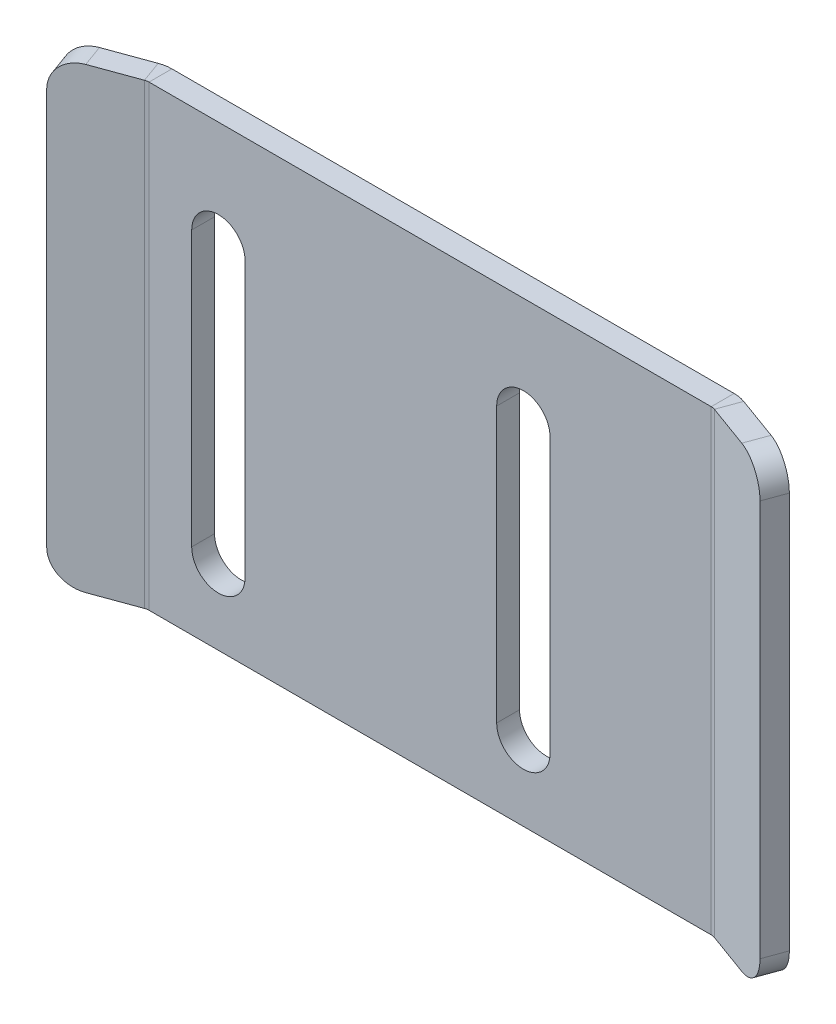
ISO-10303-21;
HEADER;
FILE_DESCRIPTION(('STEP AP214'),'2;1');
FILE_NAME('part.step','',(''),(''),'','','');
FILE_SCHEMA(('AUTOMOTIVE_DESIGN { 1 0 10303 214 1 1 1 1 }'));
ENDSEC;
DATA;
#1=APPLICATION_CONTEXT('core data for automotive mechanical design processes');
#2=APPLICATION_PROTOCOL_DEFINITION('international standard','automotive_design',2000,#1);
#3=PRODUCT_CONTEXT('',#1,'mechanical');
#4=PRODUCT('Part','Part','',(#3));
#5=PRODUCT_RELATED_PRODUCT_CATEGORY('part','',(#4));
#6=PRODUCT_DEFINITION_FORMATION('','',#4);
#7=PRODUCT_DEFINITION_CONTEXT('part definition',#1,'design');
#8=PRODUCT_DEFINITION('design','',#6,#7);
#9=PRODUCT_DEFINITION_SHAPE('','',#8);
#10=(LENGTH_UNIT() NAMED_UNIT(*) SI_UNIT(.MILLI.,.METRE.));
#11=(NAMED_UNIT(*) PLANE_ANGLE_UNIT() SI_UNIT($,.RADIAN.));
#12=(NAMED_UNIT(*) SI_UNIT($,.STERADIAN.) SOLID_ANGLE_UNIT());
#13=UNCERTAINTY_MEASURE_WITH_UNIT(LENGTH_MEASURE(1.E-05),#10,'distance_accuracy_value','');
#14=(GEOMETRIC_REPRESENTATION_CONTEXT(3) GLOBAL_UNCERTAINTY_ASSIGNED_CONTEXT((#13)) GLOBAL_UNIT_ASSIGNED_CONTEXT((#10,
#11,#12)) REPRESENTATION_CONTEXT('',''));
#15=CARTESIAN_POINT('',(0.,0.,0.));
#16=DIRECTION('',(0.,0.,1.));
#17=DIRECTION('',(1.,0.,0.));
#18=AXIS2_PLACEMENT_3D('',#15,#16,#17);
#19=CARTESIAN_POINT('',(0.,0.,-1.5));
#20=DIRECTION('',(0.,0.,1.));
#21=DIRECTION('',(1.,0.,0.));
#22=AXIS2_PLACEMENT_3D('',#19,#20,#21);
#23=PLANE('',#22);
#24=DIRECTION('',(0.,1.,0.));
#25=VECTOR('',#24,1.);
#26=CARTESIAN_POINT('',(35.0734860764899,-0.496153846153827,-1.5));
#27=LINE('',#26,#25);
#28=CARTESIAN_POINT('',(35.0734860764899,-18.4961538461538,-1.5));
#29=VERTEX_POINT('',#28);
#30=CARTESIAN_POINT('',(35.0734860764899,-0.496153846153827,-1.5));
#31=VERTEX_POINT('',#30);
#32=EDGE_CURVE('E252',#29,#31,#27,.T.);
#33=ORIENTED_EDGE('',*,*,#32,.T.);
#34=CARTESIAN_POINT('',(33.3234860764899,-0.496153846153827,-1.5));
#35=DIRECTION('',(0.,0.,1.));
#36=DIRECTION('',(1.,0.,0.));
#37=AXIS2_PLACEMENT_3D('',#34,#35,#36);
#38=CIRCLE('',#37,1.75);
#39=CARTESIAN_POINT('',(31.5734860764899,-0.496153846153828,-1.5));
#40=VERTEX_POINT('',#39);
#41=EDGE_CURVE('E244',#31,#40,#38,.T.);
#42=ORIENTED_EDGE('',*,*,#41,.T.);
#43=DIRECTION('',(0.,-1.,0.));
#44=VECTOR('',#43,1.);
#45=CARTESIAN_POINT('',(31.5734860764899,-0.496153846153828,-1.5));
#46=LINE('',#45,#44);
#47=CARTESIAN_POINT('',(31.5734860764899,-18.4961538461538,-1.5));
#48=VERTEX_POINT('',#47);
#49=EDGE_CURVE('E256',#40,#48,#46,.T.);
#50=ORIENTED_EDGE('',*,*,#49,.T.);
#51=CARTESIAN_POINT('',(33.3234860764899,-18.4961538461538,-1.5));
#52=DIRECTION('',(0.,0.,1.));
#53=DIRECTION('',(1.,0.,0.));
#54=AXIS2_PLACEMENT_3D('',#51,#52,#53);
#55=CIRCLE('',#54,1.75000000000001);
#56=EDGE_CURVE('E260',#48,#29,#55,.T.);
#57=ORIENTED_EDGE('',*,*,#56,.T.);
#58=EDGE_LOOP('',(#33,#42,#50,#57));
#59=FACE_BOUND('',#58,.T.);
#60=DIRECTION('',(0.,1.,0.));
#61=VECTOR('',#60,1.);
#62=CARTESIAN_POINT('',(15.0734860764899,-0.496153846153848,-1.5));
#63=LINE('',#62,#61);
#64=CARTESIAN_POINT('',(15.0734860764899,-18.4961538461538,-1.5));
#65=VERTEX_POINT('',#64);
#66=CARTESIAN_POINT('',(15.0734860764899,-0.496153846153848,-1.5));
#67=VERTEX_POINT('',#66);
#68=EDGE_CURVE('E293',#65,#67,#63,.T.);
#69=ORIENTED_EDGE('',*,*,#68,.T.);
#70=CARTESIAN_POINT('',(13.3234860764899,-0.496153846153848,-1.5));
#71=DIRECTION('',(0.,0.,1.));
#72=DIRECTION('',(1.,0.,0.));
#73=AXIS2_PLACEMENT_3D('',#70,#71,#72);
#74=CIRCLE('',#73,1.75);
#75=CARTESIAN_POINT('',(11.5734860764899,-0.496153846153848,-1.5));
#76=VERTEX_POINT('',#75);
#77=EDGE_CURVE('E283',#67,#76,#74,.T.);
#78=ORIENTED_EDGE('',*,*,#77,.T.);
#79=DIRECTION('',(0.,-1.,0.));
#80=VECTOR('',#79,1.);
#81=CARTESIAN_POINT('',(11.5734860764899,-0.496153846153848,-1.5));
#82=LINE('',#81,#80);
#83=CARTESIAN_POINT('',(11.5734860764899,-18.4961538461538,-1.5));
#84=VERTEX_POINT('',#83);
#85=EDGE_CURVE('E286',#76,#84,#82,.T.);
#86=ORIENTED_EDGE('',*,*,#85,.T.);
#87=CARTESIAN_POINT('',(13.3234860764899,-18.4961538461538,-1.5));
#88=DIRECTION('',(0.,0.,1.));
#89=DIRECTION('',(1.,0.,0.));
#90=AXIS2_PLACEMENT_3D('',#87,#88,#89);
#91=CIRCLE('',#90,1.75);
#92=EDGE_CURVE('E290',#84,#65,#91,.T.);
#93=ORIENTED_EDGE('',*,*,#92,.T.);
#94=EDGE_LOOP('',(#69,#78,#86,#93));
#95=FACE_BOUND('',#94,.T.);
#96=DIRECTION('',(0.,1.,0.));
#97=VECTOR('',#96,1.);
#98=CARTESIAN_POINT('',(45.6442400055945,6.50384615384615,-1.5));
#99=LINE('',#98,#97);
#100=CARTESIAN_POINT('',(45.6442400055945,6.50384615384615,-1.5));
#101=VERTEX_POINT('',#100);
#102=CARTESIAN_POINT('',(45.6442400055945,-23.4961538461538,-1.5));
#103=VERTEX_POINT('',#102);
#104=EDGE_CURVE('E338',#101,#103,#99,.F.);
#105=ORIENTED_EDGE('',*,*,#104,.T.);
#106=DIRECTION('',(1.,0.,0.));
#107=VECTOR('',#106,1.);
#108=CARTESIAN_POINT('',(4.25982905982907,-23.4961538461538,-1.5));
#109=LINE('',#108,#107);
#110=CARTESIAN_POINT('',(8.77541811406363,-23.4961538461538,-1.5));
#111=VERTEX_POINT('',#110);
#112=EDGE_CURVE('E412',#111,#103,#109,.T.);
#113=ORIENTED_EDGE('',*,*,#112,.F.);
#114=DIRECTION('',(0.,-1.,0.));
#115=VECTOR('',#114,1.);
#116=CARTESIAN_POINT('',(8.77541811406363,-23.4961538461538,-1.5));
#117=LINE('',#116,#115);
#118=CARTESIAN_POINT('',(8.77541811406363,6.50384615384616,-1.5));
#119=VERTEX_POINT('',#118);
#120=EDGE_CURVE('E388',#111,#119,#117,.F.);
#121=ORIENTED_EDGE('',*,*,#120,.T.);
#122=DIRECTION('',(-1.,0.,0.));
#123=VECTOR('',#122,1.);
#124=CARTESIAN_POINT('',(4.25982905982907,6.50384615384615,-1.5));
#125=LINE('',#124,#123);
#126=EDGE_CURVE('E415',#101,#119,#125,.T.);
#127=ORIENTED_EDGE('',*,*,#126,.F.);
#128=EDGE_LOOP('',(#105,#113,#121,#127));
#129=FACE_BOUND('',#128,.T.);
#130=ADVANCED_FACE('F77',(#59,#95,#129),#23,.F.);
#131=CARTESIAN_POINT('',(0.,0.,0.));
#132=DIRECTION('',(0.,0.,1.));
#133=DIRECTION('',(1.,0.,0.));
#134=AXIS2_PLACEMENT_3D('',#131,#132,#133);
#135=PLANE('',#134);
#136=CARTESIAN_POINT('',(33.3234860764899,-0.496153846153827,0.));
#137=DIRECTION('',(0.,0.,1.));
#138=DIRECTION('',(1.,0.,0.));
#139=AXIS2_PLACEMENT_3D('',#136,#137,#138);
#140=CIRCLE('',#139,1.75);
#141=CARTESIAN_POINT('',(35.0734860764899,-0.496153846153827,0.));
#142=VERTEX_POINT('',#141);
#143=CARTESIAN_POINT('',(31.5734860764899,-0.496153846153828,0.));
#144=VERTEX_POINT('',#143);
#145=EDGE_CURVE('E247',#142,#144,#140,.T.);
#146=ORIENTED_EDGE('',*,*,#145,.F.);
#147=DIRECTION('',(0.,1.,0.));
#148=VECTOR('',#147,1.);
#149=CARTESIAN_POINT('',(35.0734860764899,-0.496153846153827,0.));
#150=LINE('',#149,#148);
#151=CARTESIAN_POINT('',(35.0734860764899,-18.4961538461538,0.));
#152=VERTEX_POINT('',#151);
#153=EDGE_CURVE('E264',#152,#142,#150,.T.);
#154=ORIENTED_EDGE('',*,*,#153,.F.);
#155=CARTESIAN_POINT('',(33.3234860764899,-18.4961538461538,0.));
#156=DIRECTION('',(0.,0.,1.));
#157=DIRECTION('',(1.,0.,0.));
#158=AXIS2_PLACEMENT_3D('',#155,#156,#157);
#159=CIRCLE('',#158,1.75000000000001);
#160=CARTESIAN_POINT('',(31.5734860764899,-18.4961538461538,0.));
#161=VERTEX_POINT('',#160);
#162=EDGE_CURVE('E267',#161,#152,#159,.T.);
#163=ORIENTED_EDGE('',*,*,#162,.F.);
#164=DIRECTION('',(0.,-1.,0.));
#165=VECTOR('',#164,1.);
#166=CARTESIAN_POINT('',(31.5734860764899,-0.496153846153828,0.));
#167=LINE('',#166,#165);
#168=EDGE_CURVE('E273',#144,#161,#167,.T.);
#169=ORIENTED_EDGE('',*,*,#168,.F.);
#170=EDGE_LOOP('',(#146,#154,#163,#169));
#171=FACE_BOUND('',#170,.T.);
#172=CARTESIAN_POINT('',(13.3234860764899,-0.496153846153848,0.));
#173=DIRECTION('',(0.,0.,1.));
#174=DIRECTION('',(1.,0.,0.));
#175=AXIS2_PLACEMENT_3D('',#172,#173,#174);
#176=CIRCLE('',#175,1.75);
#177=CARTESIAN_POINT('',(15.0734860764899,-0.496153846153848,0.));
#178=VERTEX_POINT('',#177);
#179=CARTESIAN_POINT('',(11.5734860764899,-0.496153846153848,0.));
#180=VERTEX_POINT('',#179);
#181=EDGE_CURVE('E279',#178,#180,#176,.T.);
#182=ORIENTED_EDGE('',*,*,#181,.F.);
#183=DIRECTION('',(0.,1.,0.));
#184=VECTOR('',#183,1.);
#185=CARTESIAN_POINT('',(15.0734860764899,-0.496153846153848,0.));
#186=LINE('',#185,#184);
#187=CARTESIAN_POINT('',(15.0734860764899,-18.4961538461538,0.));
#188=VERTEX_POINT('',#187);
#189=EDGE_CURVE('E287',#188,#178,#186,.T.);
#190=ORIENTED_EDGE('',*,*,#189,.F.);
#191=CARTESIAN_POINT('',(13.3234860764899,-18.4961538461538,0.));
#192=DIRECTION('',(0.,0.,1.));
#193=DIRECTION('',(1.,0.,0.));
#194=AXIS2_PLACEMENT_3D('',#191,#192,#193);
#195=CIRCLE('',#194,1.75);
#196=CARTESIAN_POINT('',(11.5734860764899,-18.4961538461538,0.));
#197=VERTEX_POINT('',#196);
#198=EDGE_CURVE('E301',#197,#188,#195,.T.);
#199=ORIENTED_EDGE('',*,*,#198,.F.);
#200=DIRECTION('',(0.,-1.,0.));
#201=VECTOR('',#200,1.);
#202=CARTESIAN_POINT('',(11.5734860764899,-0.496153846153848,0.));
#203=LINE('',#202,#201);
#204=EDGE_CURVE('E298',#180,#197,#203,.T.);
#205=ORIENTED_EDGE('',*,*,#204,.F.);
#206=EDGE_LOOP('',(#182,#190,#199,#205));
#207=FACE_BOUND('',#206,.T.);
#208=DIRECTION('',(1.,0.,0.));
#209=VECTOR('',#208,1.);
#210=CARTESIAN_POINT('',(4.25982905982907,-23.4961538461538,0.));
#211=LINE('',#210,#209);
#212=CARTESIAN_POINT('',(8.77541811406363,-23.4961538461538,0.));
#213=VERTEX_POINT('',#212);
#214=CARTESIAN_POINT('',(45.6442400055945,-23.4961538461538,0.));
#215=VERTEX_POINT('',#214);
#216=EDGE_CURVE('E409',#213,#215,#211,.T.);
#217=ORIENTED_EDGE('',*,*,#216,.T.);
#218=DIRECTION('',(0.,1.,0.));
#219=VECTOR('',#218,1.);
#220=CARTESIAN_POINT('',(45.6442400055945,6.50384615384615,0.));
#221=LINE('',#220,#219);
#222=CARTESIAN_POINT('',(45.6442400055945,6.50384615384615,0.));
#223=VERTEX_POINT('',#222);
#224=EDGE_CURVE('E350',#223,#215,#221,.F.);
#225=ORIENTED_EDGE('',*,*,#224,.F.);
#226=DIRECTION('',(-1.,0.,0.));
#227=VECTOR('',#226,1.);
#228=CARTESIAN_POINT('',(4.25982905982907,6.50384615384615,0.));
#229=LINE('',#228,#227);
#230=CARTESIAN_POINT('',(8.77541811406363,6.50384615384615,0.));
#231=VERTEX_POINT('',#230);
#232=EDGE_CURVE('E416',#223,#231,#229,.T.);
#233=ORIENTED_EDGE('',*,*,#232,.T.);
#234=DIRECTION('',(0.,-1.,0.));
#235=VECTOR('',#234,1.);
#236=CARTESIAN_POINT('',(8.77541811406363,-23.4961538461538,0.));
#237=LINE('',#236,#235);
#238=EDGE_CURVE('E401',#213,#231,#237,.F.);
#239=ORIENTED_EDGE('',*,*,#238,.F.);
#240=EDGE_LOOP('',(#217,#225,#233,#239));
#241=FACE_BOUND('',#240,.T.);
#242=ADVANCED_FACE('F490',(#171,#207,#241),#135,.T.);
#243=CARTESIAN_POINT('',(4.25982905982907,6.50384615384615,-1.5));
#244=DIRECTION('',(0.,1.,0.));
#245=DIRECTION('',(0.,0.,1.));
#246=AXIS2_PLACEMENT_3D('',#243,#244,#245);
#247=PLANE('',#246);
#248=ORIENTED_EDGE('',*,*,#232,.F.);
#249=DIRECTION('',(0.,0.,-1.));
#250=VECTOR('',#249,1.);
#251=CARTESIAN_POINT('',(45.6442400055945,6.50384615384615,0.));
#252=LINE('',#251,#250);
#253=EDGE_CURVE('E344',#223,#101,#252,.T.);
#254=ORIENTED_EDGE('',*,*,#253,.T.);
#255=ORIENTED_EDGE('',*,*,#126,.T.);
#256=DIRECTION('',(0.,0.,-1.));
#257=VECTOR('',#256,1.);
#258=CARTESIAN_POINT('',(8.77541811406363,6.50384615384615,0.));
#259=LINE('',#258,#257);
#260=EDGE_CURVE('E406',#231,#119,#259,.T.);
#261=ORIENTED_EDGE('',*,*,#260,.F.);
#262=EDGE_LOOP('',(#248,#254,#255,#261));
#263=FACE_BOUND('',#262,.T.);
#264=ADVANCED_FACE('F508',(#263),#247,.T.);
#265=CARTESIAN_POINT('',(4.25982905982907,-23.4961538461538,-1.5));
#266=DIRECTION('',(0.,-1.,0.));
#267=DIRECTION('',(0.,0.,-1.));
#268=AXIS2_PLACEMENT_3D('',#265,#266,#267);
#269=PLANE('',#268);
#270=DIRECTION('',(0.,0.,-1.));
#271=VECTOR('',#270,1.);
#272=CARTESIAN_POINT('',(45.6442400055945,-23.4961538461538,0.));
#273=LINE('',#272,#271);
#274=EDGE_CURVE('E355',#215,#103,#273,.T.);
#275=ORIENTED_EDGE('',*,*,#274,.F.);
#276=ORIENTED_EDGE('',*,*,#216,.F.);
#277=DIRECTION('',(0.,0.,-1.));
#278=VECTOR('',#277,1.);
#279=CARTESIAN_POINT('',(8.77541811406363,-23.4961538461538,0.));
#280=LINE('',#279,#278);
#281=EDGE_CURVE('E395',#213,#111,#280,.T.);
#282=ORIENTED_EDGE('',*,*,#281,.T.);
#283=ORIENTED_EDGE('',*,*,#112,.T.);
#284=EDGE_LOOP('',(#275,#276,#282,#283));
#285=FACE_BOUND('',#284,.T.);
#286=ADVANCED_FACE('F487',(#285),#269,.T.);
#287=CARTESIAN_POINT('',(8.77541811406362,6.50384615384615,0.736600000000001));
#288=DIRECTION('',(0.,1.,0.));
#289=DIRECTION('',(0.,0.,1.));
#290=AXIS2_PLACEMENT_3D('',#287,#288,#289);
#291=PLANE('',#290);
#292=DIRECTION('',(0.342020143325663,0.,0.939692620785911));
#293=VECTOR('',#292,1.);
#294=CARTESIAN_POINT('',(8.01045586150144,6.50384615384615,-1.36511651564977));
#295=LINE('',#294,#293);
#296=CARTESIAN_POINT('',(8.52348607648994,6.50384615384615,0.0444224155290986));
#297=VERTEX_POINT('',#296);
#298=CARTESIAN_POINT('',(8.01045586150145,6.50384615384615,-1.36511651564977));
#299=VERTEX_POINT('',#298);
#300=EDGE_CURVE('E358',#297,#299,#295,.F.);
#301=ORIENTED_EDGE('',*,*,#300,.F.);
#302=CARTESIAN_POINT('',(8.77541811406362,6.50384615384615,0.736600000000001));
#303=DIRECTION('',(0.,-1.,0.));
#304=DIRECTION('',(0.,0.,-1.));
#305=AXIS2_PLACEMENT_3D('',#302,#303,#304);
#306=CIRCLE('',#305,0.736600000000001);
#307=EDGE_CURVE('E398',#231,#297,#306,.F.);
#308=ORIENTED_EDGE('',*,*,#307,.F.);
#309=ORIENTED_EDGE('',*,*,#260,.T.);
#310=CARTESIAN_POINT('',(8.77541811406362,6.50384615384615,0.736600000000001));
#311=DIRECTION('',(0.,-1.,0.));
#312=DIRECTION('',(0.,0.,-1.));
#313=AXIS2_PLACEMENT_3D('',#310,#311,#312);
#314=CIRCLE('',#313,2.2366);
#315=EDGE_CURVE('E391',#119,#299,#314,.F.);
#316=ORIENTED_EDGE('',*,*,#315,.T.);
#317=EDGE_LOOP('',(#301,#308,#309,#316));
#318=FACE_BOUND('',#317,.T.);
#319=ADVANCED_FACE('F520',(#318),#291,.T.);
#320=CARTESIAN_POINT('',(8.77541811406362,-23.4961538461538,0.736600000000001));
#321=DIRECTION('',(0.,1.,0.));
#322=DIRECTION('',(0.,0.,1.));
#323=AXIS2_PLACEMENT_3D('',#320,#321,#322);
#324=PLANE('',#323);
#325=CARTESIAN_POINT('',(8.77541811406362,-23.4961538461538,0.736600000000001));
#326=DIRECTION('',(0.,-1.,0.));
#327=DIRECTION('',(0.,0.,-1.));
#328=AXIS2_PLACEMENT_3D('',#325,#326,#327);
#329=CIRCLE('',#328,0.736600000000001);
#330=CARTESIAN_POINT('',(8.52348607648994,-23.4961538461538,0.0444224155290986));
#331=VERTEX_POINT('',#330);
#332=EDGE_CURVE('E363',#331,#213,#329,.T.);
#333=ORIENTED_EDGE('',*,*,#332,.F.);
#334=DIRECTION('',(0.342020143325663,0.,0.939692620785911));
#335=VECTOR('',#334,1.);
#336=CARTESIAN_POINT('',(8.52348607648994,-23.4961538461538,0.0444224155290982));
#337=LINE('',#336,#335);
#338=CARTESIAN_POINT('',(8.01045586150145,-23.4961538461538,-1.36511651564977));
#339=VERTEX_POINT('',#338);
#340=EDGE_CURVE('E381',#331,#339,#337,.F.);
#341=ORIENTED_EDGE('',*,*,#340,.T.);
#342=CARTESIAN_POINT('',(8.77541811406362,-23.4961538461538,0.736600000000001));
#343=DIRECTION('',(0.,-1.,0.));
#344=DIRECTION('',(0.,0.,-1.));
#345=AXIS2_PLACEMENT_3D('',#342,#343,#344);
#346=CIRCLE('',#345,2.2366);
#347=EDGE_CURVE('E392',#339,#111,#346,.T.);
#348=ORIENTED_EDGE('',*,*,#347,.T.);
#349=ORIENTED_EDGE('',*,*,#281,.F.);
#350=EDGE_LOOP('',(#333,#341,#348,#349));
#351=FACE_BOUND('',#350,.T.);
#352=ADVANCED_FACE('F512',(#351),#324,.F.);
#353=CARTESIAN_POINT('',(8.77541811406362,-23.4961538461538,0.736600000000001));
#354=DIRECTION('',(0.,-1.,0.));
#355=DIRECTION('',(-0.342020143325663,0.,-0.93969262078591));
#356=AXIS2_PLACEMENT_3D('',#353,#354,#355);
#357=CYLINDRICAL_SURFACE('',#356,2.2366);
#358=ORIENTED_EDGE('',*,*,#120,.F.);
#359=ORIENTED_EDGE('',*,*,#347,.F.);
#360=DIRECTION('',(0.,-1.,0.));
#361=VECTOR('',#360,1.);
#362=CARTESIAN_POINT('',(8.01045586150144,6.50384615384615,-1.36511651564977));
#363=LINE('',#362,#361);
#364=EDGE_CURVE('E378',#339,#299,#363,.F.);
#365=ORIENTED_EDGE('',*,*,#364,.T.);
#366=ORIENTED_EDGE('',*,*,#315,.F.);
#367=EDGE_LOOP('',(#358,#359,#365,#366));
#368=FACE_BOUND('',#367,.T.);
#369=ADVANCED_FACE('F797',(#368),#357,.T.);
#370=CARTESIAN_POINT('',(8.77541811406362,-23.4961538461538,0.736600000000001));
#371=DIRECTION('',(0.,-1.,0.));
#372=DIRECTION('',(-0.342020143325663,0.,-0.93969262078591));
#373=AXIS2_PLACEMENT_3D('',#370,#371,#372);
#374=CYLINDRICAL_SURFACE('',#373,0.736600000000001);
#375=ORIENTED_EDGE('',*,*,#238,.T.);
#376=ORIENTED_EDGE('',*,*,#307,.T.);
#377=DIRECTION('',(0.,-1.,0.));
#378=VECTOR('',#377,1.);
#379=CARTESIAN_POINT('',(8.52348607648994,6.50384615384615,0.0444224155290993));
#380=LINE('',#379,#378);
#381=EDGE_CURVE('E384',#297,#331,#380,.T.);
#382=ORIENTED_EDGE('',*,*,#381,.T.);
#383=ORIENTED_EDGE('',*,*,#332,.T.);
#384=EDGE_LOOP('',(#375,#376,#382,#383));
#385=FACE_BOUND('',#384,.T.);
#386=ADVANCED_FACE('F655',(#385),#374,.F.);
#387=CARTESIAN_POINT('',(3.30670503676717,-23.4961538461538,0.34690877395858));
#388=DIRECTION('',(0.,1.,0.));
#389=DIRECTION('',(0.,0.,1.));
#390=AXIS2_PLACEMENT_3D('',#387,#388,#389);
#391=PLANE('',#390);
#392=DIRECTION('',(0.939692620785911,0.,-0.342020143325663));
#393=VECTOR('',#392,1.);
#394=CARTESIAN_POINT('',(3.81973525175566,-23.4961538461538,1.75644770513745));
#395=LINE('',#394,#393);
#396=CARTESIAN_POINT('',(5.69912049332748,-23.4961538461538,1.07240741848612));
#397=VERTEX_POINT('',#396);
#398=EDGE_CURVE('E375',#331,#397,#395,.F.);
#399=ORIENTED_EDGE('',*,*,#398,.T.);
#400=DIRECTION('',(0.342020143325663,0.,0.939692620785911));
#401=VECTOR('',#400,1.);
#402=CARTESIAN_POINT('',(5.18609027833899,-23.4961538461538,-0.337131512692746));
#403=LINE('',#402,#401);
#404=CARTESIAN_POINT('',(5.18609027833899,-23.4961538461539,-0.337131512692746));
#405=VERTEX_POINT('',#404);
#406=EDGE_CURVE('E437',#397,#405,#403,.F.);
#407=ORIENTED_EDGE('',*,*,#406,.T.);
#408=DIRECTION('',(-0.939692620785911,0.,0.342020143325663));
#409=VECTOR('',#408,1.);
#410=CARTESIAN_POINT('',(4.37098172521133,-23.4961538461539,-0.0404562616584919));
#411=LINE('',#410,#409);
#412=EDGE_CURVE('E367',#339,#405,#411,.T.);
#413=ORIENTED_EDGE('',*,*,#412,.F.);
#414=ORIENTED_EDGE('',*,*,#340,.F.);
#415=EDGE_LOOP('',(#399,#407,#413,#414));
#416=FACE_BOUND('',#415,.T.);
#417=ADVANCED_FACE('F644',(#416),#391,.F.);
#418=CARTESIAN_POINT('',(8.13250544508528,6.50384615384615,-1.40953893117887));
#419=DIRECTION('',(0.,-1.,0.));
#420=DIRECTION('',(0.,0.,-1.));
#421=AXIS2_PLACEMENT_3D('',#418,#419,#420);
#422=PLANE('',#421);
#423=DIRECTION('',(0.939692620785911,0.,-0.342020143325663));
#424=VECTOR('',#423,1.);
#425=CARTESIAN_POINT('',(4.37098172521133,6.50384615384615,-0.040456261658493));
#426=LINE('',#425,#424);
#427=CARTESIAN_POINT('',(5.18609027833898,6.50384615384615,-0.337131512692746));
#428=VERTEX_POINT('',#427);
#429=EDGE_CURVE('E361',#428,#299,#426,.T.);
#430=ORIENTED_EDGE('',*,*,#429,.F.);
#431=DIRECTION('',(0.342020143325663,0.,0.939692620785911));
#432=VECTOR('',#431,1.);
#433=CARTESIAN_POINT('',(5.18609027833898,6.50384615384615,-0.337131512692747));
#434=LINE('',#433,#432);
#435=CARTESIAN_POINT('',(5.69912049332748,6.50384615384615,1.07240741848612));
#436=VERTEX_POINT('',#435);
#437=EDGE_CURVE('E418',#428,#436,#434,.T.);
#438=ORIENTED_EDGE('',*,*,#437,.T.);
#439=DIRECTION('',(-0.939692620785911,0.,0.342020143325663));
#440=VECTOR('',#439,1.);
#441=CARTESIAN_POINT('',(8.64553566007377,6.50384615384615,0.));
#442=LINE('',#441,#440);
#443=EDGE_CURVE('E370',#436,#297,#442,.F.);
#444=ORIENTED_EDGE('',*,*,#443,.T.);
#445=ORIENTED_EDGE('',*,*,#300,.T.);
#446=EDGE_LOOP('',(#430,#438,#444,#445));
#447=FACE_BOUND('',#446,.T.);
#448=ADVANCED_FACE('F633',(#447),#422,.F.);
#449=CARTESIAN_POINT('',(4.37098172521133,0.,-0.0404562616584927));
#450=DIRECTION('',(0.342020143325663,0.,0.939692620785911));
#451=DIRECTION('',(0.93969262078591,0.,-0.342020143325663));
#452=AXIS2_PLACEMENT_3D('',#449,#450,#451);
#453=PLANE('',#452);
#454=DIRECTION('',(0.,1.,0.));
#455=VECTOR('',#454,1.);
#456=CARTESIAN_POINT('',(3.30670503676716,0.,0.346908773958581));
#457=LINE('',#456,#455);
#458=CARTESIAN_POINT('',(3.30670503676717,-21.4961538461539,0.346908773958581));
#459=VERTEX_POINT('',#458);
#460=CARTESIAN_POINT('',(3.30670503676716,4.50384615384615,0.346908773958581));
#461=VERTEX_POINT('',#460);
#462=EDGE_CURVE('E364',#459,#461,#457,.T.);
#463=ORIENTED_EDGE('',*,*,#462,.T.);
#464=CARTESIAN_POINT('',(5.18609027833898,4.50384615384615,-0.337131512692746));
#465=DIRECTION('',(0.342020143325663,0.,0.939692620785911));
#466=DIRECTION('',(0.93969262078591,0.,-0.342020143325663));
#467=AXIS2_PLACEMENT_3D('',#464,#465,#466);
#468=CIRCLE('',#467,2.);
#469=EDGE_CURVE('E435',#461,#428,#468,.F.);
#470=ORIENTED_EDGE('',*,*,#469,.T.);
#471=ORIENTED_EDGE('',*,*,#429,.T.);
#472=ORIENTED_EDGE('',*,*,#364,.F.);
#473=ORIENTED_EDGE('',*,*,#412,.T.);
#474=CARTESIAN_POINT('',(5.18609027833899,-21.4961538461539,-0.337131512692746));
#475=DIRECTION('',(0.342020143325663,0.,0.939692620785911));
#476=DIRECTION('',(0.93969262078591,0.,-0.342020143325663));
#477=AXIS2_PLACEMENT_3D('',#474,#475,#476);
#478=CIRCLE('',#477,2.);
#479=EDGE_CURVE('E433',#405,#459,#478,.F.);
#480=ORIENTED_EDGE('',*,*,#479,.T.);
#481=EDGE_LOOP('',(#463,#470,#471,#472,#473,#480));
#482=FACE_BOUND('',#481,.T.);
#483=ADVANCED_FACE('F622',(#482),#453,.F.);
#484=CARTESIAN_POINT('',(4.88401194019982,0.,1.36908266952037));
#485=DIRECTION('',(0.342020143325663,0.,0.939692620785911));
#486=DIRECTION('',(0.93969262078591,0.,-0.342020143325663));
#487=AXIS2_PLACEMENT_3D('',#484,#485,#486);
#488=PLANE('',#487);
#489=ORIENTED_EDGE('',*,*,#443,.F.);
#490=CARTESIAN_POINT('',(5.69912049332748,4.50384615384615,1.07240741848612));
#491=DIRECTION('',(0.342020143325663,0.,0.939692620785911));
#492=DIRECTION('',(0.93969262078591,0.,-0.342020143325663));
#493=AXIS2_PLACEMENT_3D('',#490,#491,#492);
#494=CIRCLE('',#493,2.);
#495=CARTESIAN_POINT('',(3.81973525175566,4.50384615384615,1.75644770513745));
#496=VERTEX_POINT('',#495);
#497=EDGE_CURVE('E426',#436,#496,#494,.T.);
#498=ORIENTED_EDGE('',*,*,#497,.T.);
#499=DIRECTION('',(0.,-1.,0.));
#500=VECTOR('',#499,1.);
#501=CARTESIAN_POINT('',(3.81973525175566,6.50384615384615,1.75644770513745));
#502=LINE('',#501,#500);
#503=CARTESIAN_POINT('',(3.81973525175566,-21.4961538461539,1.75644770513745));
#504=VERTEX_POINT('',#503);
#505=EDGE_CURVE('E372',#504,#496,#502,.F.);
#506=ORIENTED_EDGE('',*,*,#505,.F.);
#507=CARTESIAN_POINT('',(5.69912049332748,-21.4961538461539,1.07240741848612));
#508=DIRECTION('',(0.342020143325663,0.,0.939692620785911));
#509=DIRECTION('',(0.93969262078591,0.,-0.342020143325663));
#510=AXIS2_PLACEMENT_3D('',#507,#508,#509);
#511=CIRCLE('',#510,2.);
#512=EDGE_CURVE('E424',#504,#397,#511,.T.);
#513=ORIENTED_EDGE('',*,*,#512,.T.);
#514=ORIENTED_EDGE('',*,*,#398,.F.);
#515=ORIENTED_EDGE('',*,*,#381,.F.);
#516=EDGE_LOOP('',(#489,#498,#506,#513,#514,#515));
#517=FACE_BOUND('',#516,.T.);
#518=ADVANCED_FACE('F609',(#517),#488,.T.);
#519=CARTESIAN_POINT('',(3.30670503676716,6.50384615384615,0.34690877395858));
#520=DIRECTION('',(0.93969262078591,0.,-0.342020143325663));
#521=DIRECTION('',(-0.342020143325663,0.,-0.939692620785911));
#522=AXIS2_PLACEMENT_3D('',#519,#520,#521);
#523=PLANE('',#522);
#524=ORIENTED_EDGE('',*,*,#505,.T.);
#525=DIRECTION('',(0.342020143325663,0.,0.939692620785911));
#526=VECTOR('',#525,1.);
#527=CARTESIAN_POINT('',(3.30670503676716,4.50384615384615,0.34690877395858));
#528=LINE('',#527,#526);
#529=EDGE_CURVE('E431',#496,#461,#528,.F.);
#530=ORIENTED_EDGE('',*,*,#529,.T.);
#531=ORIENTED_EDGE('',*,*,#462,.F.);
#532=DIRECTION('',(0.342020143325663,0.,0.939692620785911));
#533=VECTOR('',#532,1.);
#534=CARTESIAN_POINT('',(3.30670503676716,-21.4961538461539,0.34690877395858));
#535=LINE('',#534,#533);
#536=EDGE_CURVE('E428',#459,#504,#535,.T.);
#537=ORIENTED_EDGE('',*,*,#536,.T.);
#538=EDGE_LOOP('',(#524,#530,#531,#537));
#539=FACE_BOUND('',#538,.T.);
#540=ADVANCED_FACE('F604',(#539),#523,.F.);
#541=CARTESIAN_POINT('',(45.6442400055945,-23.4961538461538,0.736600000000009));
#542=DIRECTION('',(0.,-1.,0.));
#543=DIRECTION('',(0.,0.,-1.));
#544=AXIS2_PLACEMENT_3D('',#541,#542,#543);
#545=PLANE('',#544);
#546=DIRECTION('',(-0.342020143325663,0.,0.939692620785911));
#547=VECTOR('',#546,1.);
#548=CARTESIAN_POINT('',(46.4092022581567,-23.4961538461538,-1.36511651564977));
#549=LINE('',#548,#547);
#550=CARTESIAN_POINT('',(45.8961720431682,-23.4961538461538,0.0444224155291027));
#551=VERTEX_POINT('',#550);
#552=CARTESIAN_POINT('',(46.4092022581567,-23.4961538461538,-1.36511651564976));
#553=VERTEX_POINT('',#552);
#554=EDGE_CURVE('E308',#551,#553,#549,.F.);
#555=ORIENTED_EDGE('',*,*,#554,.F.);
#556=CARTESIAN_POINT('',(45.6442400055945,-23.4961538461538,0.736600000000009));
#557=DIRECTION('',(0.,1.,0.));
#558=DIRECTION('',(0.,0.,1.));
#559=AXIS2_PLACEMENT_3D('',#556,#557,#558);
#560=CIRCLE('',#559,0.736600000000005);
#561=EDGE_CURVE('E347',#215,#551,#560,.F.);
#562=ORIENTED_EDGE('',*,*,#561,.F.);
#563=ORIENTED_EDGE('',*,*,#274,.T.);
#564=CARTESIAN_POINT('',(45.6442400055945,-23.4961538461538,0.736600000000009));
#565=DIRECTION('',(0.,1.,0.));
#566=DIRECTION('',(0.,0.,1.));
#567=AXIS2_PLACEMENT_3D('',#564,#565,#566);
#568=CIRCLE('',#567,2.23660000000001);
#569=EDGE_CURVE('E340',#103,#553,#568,.F.);
#570=ORIENTED_EDGE('',*,*,#569,.T.);
#571=EDGE_LOOP('',(#555,#562,#563,#570));
#572=FACE_BOUND('',#571,.T.);
#573=ADVANCED_FACE('F483',(#572),#545,.T.);
#574=CARTESIAN_POINT('',(45.6442400055945,6.50384615384615,0.736600000000004));
#575=DIRECTION('',(0.,-1.,0.));
#576=DIRECTION('',(0.,0.,-1.));
#577=AXIS2_PLACEMENT_3D('',#574,#575,#576);
#578=PLANE('',#577);
#579=CARTESIAN_POINT('',(45.6442400055945,6.50384615384615,0.736600000000004));
#580=DIRECTION('',(0.,1.,0.));
#581=DIRECTION('',(0.,0.,1.));
#582=AXIS2_PLACEMENT_3D('',#579,#580,#581);
#583=CIRCLE('',#582,0.736600000000005);
#584=CARTESIAN_POINT('',(45.8961720431682,6.50384615384615,0.0444224155290982));
#585=VERTEX_POINT('',#584);
#586=EDGE_CURVE('E317',#585,#223,#583,.T.);
#587=ORIENTED_EDGE('',*,*,#586,.F.);
#588=DIRECTION('',(-0.342020143325663,0.,0.939692620785911));
#589=VECTOR('',#588,1.);
#590=CARTESIAN_POINT('',(45.8961720431682,6.50384615384615,0.0444224155291026));
#591=LINE('',#590,#589);
#592=CARTESIAN_POINT('',(46.4092022581567,6.50384615384615,-1.36511651564976));
#593=VERTEX_POINT('',#592);
#594=EDGE_CURVE('E331',#585,#593,#591,.F.);
#595=ORIENTED_EDGE('',*,*,#594,.T.);
#596=CARTESIAN_POINT('',(45.6442400055945,6.50384615384615,0.736600000000004));
#597=DIRECTION('',(0.,1.,0.));
#598=DIRECTION('',(0.,0.,1.));
#599=AXIS2_PLACEMENT_3D('',#596,#597,#598);
#600=CIRCLE('',#599,2.23660000000001);
#601=EDGE_CURVE('E341',#593,#101,#600,.T.);
#602=ORIENTED_EDGE('',*,*,#601,.T.);
#603=ORIENTED_EDGE('',*,*,#253,.F.);
#604=EDGE_LOOP('',(#587,#595,#602,#603));
#605=FACE_BOUND('',#604,.T.);
#606=ADVANCED_FACE('F476',(#605),#578,.F.);
#607=CARTESIAN_POINT('',(45.6442400055945,6.50384615384615,0.736600000000004));
#608=DIRECTION('',(0.,1.,0.));
#609=DIRECTION('',(0.342020143325663,0.,-0.93969262078591));
#610=AXIS2_PLACEMENT_3D('',#607,#608,#609);
#611=CYLINDRICAL_SURFACE('',#610,2.23660000000001);
#612=ORIENTED_EDGE('',*,*,#104,.F.);
#613=ORIENTED_EDGE('',*,*,#601,.F.);
#614=DIRECTION('',(0.,1.,0.));
#615=VECTOR('',#614,1.);
#616=CARTESIAN_POINT('',(46.4092022581567,-23.4961538461538,-1.36511651564976));
#617=LINE('',#616,#615);
#618=EDGE_CURVE('E328',#593,#553,#617,.F.);
#619=ORIENTED_EDGE('',*,*,#618,.T.);
#620=ORIENTED_EDGE('',*,*,#569,.F.);
#621=EDGE_LOOP('',(#612,#613,#619,#620));
#622=FACE_BOUND('',#621,.T.);
#623=ADVANCED_FACE('F481',(#622),#611,.T.);
#624=CARTESIAN_POINT('',(45.6442400055945,6.50384615384615,0.736600000000004));
#625=DIRECTION('',(0.,1.,0.));
#626=DIRECTION('',(0.342020143325663,0.,-0.93969262078591));
#627=AXIS2_PLACEMENT_3D('',#624,#625,#626);
#628=CYLINDRICAL_SURFACE('',#627,0.736600000000005);
#629=ORIENTED_EDGE('',*,*,#224,.T.);
#630=ORIENTED_EDGE('',*,*,#561,.T.);
#631=DIRECTION('',(0.,1.,0.));
#632=VECTOR('',#631,1.);
#633=CARTESIAN_POINT('',(45.8961720431682,-23.4961538461538,0.0444224155291046));
#634=LINE('',#633,#632);
#635=EDGE_CURVE('E334',#551,#585,#634,.T.);
#636=ORIENTED_EDGE('',*,*,#635,.T.);
#637=ORIENTED_EDGE('',*,*,#586,.T.);
#638=EDGE_LOOP('',(#629,#630,#636,#637));
#639=FACE_BOUND('',#638,.T.);
#640=ADVANCED_FACE('F493',(#639),#628,.F.);
#641=CARTESIAN_POINT('',(51.112953082891,6.50384615384616,0.346908773958584));
#642=DIRECTION('',(0.,-1.,0.));
#643=DIRECTION('',(1.,0.,0.));
#644=AXIS2_PLACEMENT_3D('',#641,#642,#643);
#645=PLANE('',#644);
#646=DIRECTION('',(-0.939692620785911,0.,-0.342020143325663));
#647=VECTOR('',#646,1.);
#648=CARTESIAN_POINT('',(50.5999228679025,6.50384615384616,1.75644770513745));
#649=LINE('',#648,#647);
#650=CARTESIAN_POINT('',(48.7205376263306,6.50384615384616,1.07240741848612));
#651=VERTEX_POINT('',#650);
#652=EDGE_CURVE('E326',#585,#651,#649,.F.);
#653=ORIENTED_EDGE('',*,*,#652,.T.);
#654=DIRECTION('',(-0.342020143325663,0.,0.939692620785911));
#655=VECTOR('',#654,1.);
#656=CARTESIAN_POINT('',(49.2335678413191,6.50384615384616,-0.337131512692745));
#657=LINE('',#656,#655);
#658=CARTESIAN_POINT('',(49.2335678413191,6.50384615384616,-0.33713151269274));
#659=VERTEX_POINT('',#658);
#660=EDGE_CURVE('E13',#651,#659,#657,.F.);
#661=ORIENTED_EDGE('',*,*,#660,.T.);
#662=DIRECTION('',(0.939692620785911,0.,0.342020143325663));
#663=VECTOR('',#662,1.);
#664=CARTESIAN_POINT('',(1.99490898511817,6.50384615384605,-17.5305972430051));
#665=LINE('',#664,#663);
#666=EDGE_CURVE('E320',#593,#659,#665,.T.);
#667=ORIENTED_EDGE('',*,*,#666,.F.);
#668=ORIENTED_EDGE('',*,*,#594,.F.);
#669=EDGE_LOOP('',(#653,#661,#667,#668));
#670=FACE_BOUND('',#669,.T.);
#671=ADVANCED_FACE('F473',(#670),#645,.F.);
#672=CARTESIAN_POINT('',(46.2871526745729,-23.4961538461538,-1.40953893117886));
#673=DIRECTION('',(0.,1.,0.));
#674=DIRECTION('',(-1.,0.,0.));
#675=AXIS2_PLACEMENT_3D('',#672,#673,#674);
#676=PLANE('',#675);
#677=DIRECTION('',(-0.939692620785911,0.,-0.342020143325663));
#678=VECTOR('',#677,1.);
#679=CARTESIAN_POINT('',(1.99490898511823,-23.4961538461539,-17.5305972430051));
#680=LINE('',#679,#678);
#681=CARTESIAN_POINT('',(49.2335678413192,-23.4961538461538,-0.337131512692733));
#682=VERTEX_POINT('',#681);
#683=EDGE_CURVE('E315',#682,#553,#680,.T.);
#684=ORIENTED_EDGE('',*,*,#683,.F.);
#685=DIRECTION('',(-0.342020143325663,0.,0.939692620785911));
#686=VECTOR('',#685,1.);
#687=CARTESIAN_POINT('',(49.2335678413192,-23.4961538461538,-0.337131512692741));
#688=LINE('',#687,#686);
#689=CARTESIAN_POINT('',(48.7205376263307,-23.4961538461538,1.07240741848613));
#690=VERTEX_POINT('',#689);
#691=EDGE_CURVE('E439',#682,#690,#688,.T.);
#692=ORIENTED_EDGE('',*,*,#691,.T.);
#693=DIRECTION('',(0.939692620785911,0.,0.342020143325663));
#694=VECTOR('',#693,1.);
#695=CARTESIAN_POINT('',(45.7741224595844,-23.4961538461538,0.));
#696=LINE('',#695,#694);
#697=EDGE_CURVE('E322',#690,#551,#696,.F.);
#698=ORIENTED_EDGE('',*,*,#697,.T.);
#699=ORIENTED_EDGE('',*,*,#554,.T.);
#700=EDGE_LOOP('',(#684,#692,#698,#699));
#701=FACE_BOUND('',#700,.T.);
#702=ADVANCED_FACE('F459',(#701),#676,.F.);
#703=CARTESIAN_POINT('',(1.99490898511818,0.,-17.5305972430051));
#704=DIRECTION('',(-0.342020143325663,0.,0.93969262078591));
#705=DIRECTION('',(0.93969262078591,0.,0.342020143325663));
#706=AXIS2_PLACEMENT_3D('',#703,#704,#705);
#707=PLANE('',#706);
#708=DIRECTION('',(0.,-1.,0.));
#709=VECTOR('',#708,1.);
#710=CARTESIAN_POINT('',(51.112953082891,0.,0.346908773958588));
#711=LINE('',#710,#709);
#712=CARTESIAN_POINT('',(51.112953082891,4.50384615384616,0.346908773958588));
#713=VERTEX_POINT('',#712);
#714=CARTESIAN_POINT('',(51.112953082891,-21.4961538461538,0.346908773958588));
#715=VERTEX_POINT('',#714);
#716=EDGE_CURVE('E318',#713,#715,#711,.T.);
#717=ORIENTED_EDGE('',*,*,#716,.T.);
#718=CARTESIAN_POINT('',(49.2335678413192,-21.4961538461538,-0.337131512692736));
#719=DIRECTION('',(-0.342020143325663,0.,0.93969262078591));
#720=DIRECTION('',(0.93969262078591,0.,0.342020143325663));
#721=AXIS2_PLACEMENT_3D('',#718,#719,#720);
#722=CIRCLE('',#721,2.);
#723=EDGE_CURVE('E85',#715,#682,#722,.F.);
#724=ORIENTED_EDGE('',*,*,#723,.T.);
#725=ORIENTED_EDGE('',*,*,#683,.T.);
#726=ORIENTED_EDGE('',*,*,#618,.F.);
#727=ORIENTED_EDGE('',*,*,#666,.T.);
#728=CARTESIAN_POINT('',(49.2335678413191,4.50384615384616,-0.337131512692739));
#729=DIRECTION('',(-0.342020143325663,0.,0.93969262078591));
#730=DIRECTION('',(0.93969262078591,0.,0.342020143325663));
#731=AXIS2_PLACEMENT_3D('',#728,#729,#730);
#732=CIRCLE('',#731,2.);
#733=EDGE_CURVE('E450',#659,#713,#732,.F.);
#734=ORIENTED_EDGE('',*,*,#733,.T.);
#735=EDGE_LOOP('',(#717,#724,#725,#726,#727,#734));
#736=FACE_BOUND('',#735,.T.);
#737=ADVANCED_FACE('F454',(#736),#707,.F.);
#738=CARTESIAN_POINT('',(1.48187877012969,0.,-16.1210583118262));
#739=DIRECTION('',(-0.342020143325663,0.,0.93969262078591));
#740=DIRECTION('',(0.93969262078591,0.,0.342020143325663));
#741=AXIS2_PLACEMENT_3D('',#738,#739,#740);
#742=PLANE('',#741);
#743=ORIENTED_EDGE('',*,*,#697,.F.);
#744=CARTESIAN_POINT('',(48.7205376263307,-21.4961538461538,1.07240741848613));
#745=DIRECTION('',(-0.342020143325663,0.,0.93969262078591));
#746=DIRECTION('',(0.93969262078591,0.,0.342020143325663));
#747=AXIS2_PLACEMENT_3D('',#744,#745,#746);
#748=CIRCLE('',#747,2.);
#749=CARTESIAN_POINT('',(50.5999228679025,-21.4961538461538,1.75644770513745));
#750=VERTEX_POINT('',#749);
#751=EDGE_CURVE('E444',#690,#750,#748,.T.);
#752=ORIENTED_EDGE('',*,*,#751,.T.);
#753=DIRECTION('',(0.,1.,0.));
#754=VECTOR('',#753,1.);
#755=CARTESIAN_POINT('',(50.5999228679025,-23.4961538461538,1.75644770513745));
#756=LINE('',#755,#754);
#757=CARTESIAN_POINT('',(50.5999228679025,4.50384615384616,1.75644770513745));
#758=VERTEX_POINT('',#757);
#759=EDGE_CURVE('E324',#758,#750,#756,.F.);
#760=ORIENTED_EDGE('',*,*,#759,.F.);
#761=CARTESIAN_POINT('',(48.7205376263306,4.50384615384616,1.07240741848613));
#762=DIRECTION('',(-0.342020143325663,0.,0.93969262078591));
#763=DIRECTION('',(0.93969262078591,0.,0.342020143325663));
#764=AXIS2_PLACEMENT_3D('',#761,#762,#763);
#765=CIRCLE('',#764,2.);
#766=EDGE_CURVE('E442',#758,#651,#765,.T.);
#767=ORIENTED_EDGE('',*,*,#766,.T.);
#768=ORIENTED_EDGE('',*,*,#652,.F.);
#769=ORIENTED_EDGE('',*,*,#635,.F.);
#770=EDGE_LOOP('',(#743,#752,#760,#767,#768,#769));
#771=FACE_BOUND('',#770,.T.);
#772=ADVANCED_FACE('F465',(#771),#742,.T.);
#773=CARTESIAN_POINT('',(51.112953082891,-23.4961538461538,0.346908773958584));
#774=DIRECTION('',(-0.93969262078591,0.,-0.342020143325663));
#775=DIRECTION('',(-0.342020143325663,0.,0.939692620785911));
#776=AXIS2_PLACEMENT_3D('',#773,#774,#775);
#777=PLANE('',#776);
#778=ORIENTED_EDGE('',*,*,#759,.T.);
#779=DIRECTION('',(-0.342020143325663,0.,0.939692620785911));
#780=VECTOR('',#779,1.);
#781=CARTESIAN_POINT('',(51.112953082891,-21.4961538461538,0.346908773958584));
#782=LINE('',#781,#780);
#783=EDGE_CURVE('E98',#750,#715,#782,.F.);
#784=ORIENTED_EDGE('',*,*,#783,.T.);
#785=ORIENTED_EDGE('',*,*,#716,.F.);
#786=DIRECTION('',(-0.342020143325663,0.,0.939692620785911));
#787=VECTOR('',#786,1.);
#788=CARTESIAN_POINT('',(51.112953082891,4.50384615384616,0.346908773958584));
#789=LINE('',#788,#787);
#790=EDGE_CURVE('E446',#713,#758,#789,.T.);
#791=ORIENTED_EDGE('',*,*,#790,.T.);
#792=EDGE_LOOP('',(#778,#784,#785,#791));
#793=FACE_BOUND('',#792,.T.);
#794=ADVANCED_FACE('F467',(#793),#777,.F.);
#795=CARTESIAN_POINT('',(13.3234860764899,-0.496153846153848,-1.5));
#796=DIRECTION('',(0.,0.,1.));
#797=DIRECTION('',(1.,0.,0.));
#798=AXIS2_PLACEMENT_3D('',#795,#796,#797);
#799=CYLINDRICAL_SURFACE('',#798,1.75);
#800=ORIENTED_EDGE('',*,*,#181,.T.);
#801=DIRECTION('',(0.,0.,1.));
#802=VECTOR('',#801,1.);
#803=CARTESIAN_POINT('',(11.5734860764899,-0.496153846153848,-1.5));
#804=LINE('',#803,#802);
#805=EDGE_CURVE('E296',#76,#180,#804,.T.);
#806=ORIENTED_EDGE('',*,*,#805,.F.);
#807=ORIENTED_EDGE('',*,*,#77,.F.);
#808=DIRECTION('',(0.,0.,1.));
#809=VECTOR('',#808,1.);
#810=CARTESIAN_POINT('',(15.0734860764899,-0.496153846153848,-1.5));
#811=LINE('',#810,#809);
#812=EDGE_CURVE('E306',#67,#178,#811,.T.);
#813=ORIENTED_EDGE('',*,*,#812,.T.);
#814=EDGE_LOOP('',(#800,#806,#807,#813));
#815=FACE_BOUND('',#814,.T.);
#816=ADVANCED_FACE('F561',(#815),#799,.F.);
#817=CARTESIAN_POINT('',(15.0734860764899,-0.496153846153848,-1.5));
#818=DIRECTION('',(1.,0.,0.));
#819=DIRECTION('',(0.,0.,-1.));
#820=AXIS2_PLACEMENT_3D('',#817,#818,#819);
#821=PLANE('',#820);
#822=ORIENTED_EDGE('',*,*,#189,.T.);
#823=ORIENTED_EDGE('',*,*,#812,.F.);
#824=ORIENTED_EDGE('',*,*,#68,.F.);
#825=DIRECTION('',(0.,0.,1.));
#826=VECTOR('',#825,1.);
#827=CARTESIAN_POINT('',(15.0734860764899,-18.4961538461538,-1.5));
#828=LINE('',#827,#826);
#829=EDGE_CURVE('E309',#65,#188,#828,.T.);
#830=ORIENTED_EDGE('',*,*,#829,.T.);
#831=EDGE_LOOP('',(#822,#823,#824,#830));
#832=FACE_BOUND('',#831,.T.);
#833=ADVANCED_FACE('F718',(#832),#821,.F.);
#834=CARTESIAN_POINT('',(13.3234860764899,-18.4961538461538,-1.5));
#835=DIRECTION('',(0.,0.,1.));
#836=DIRECTION('',(1.,0.,0.));
#837=AXIS2_PLACEMENT_3D('',#834,#835,#836);
#838=CYLINDRICAL_SURFACE('',#837,1.75);
#839=ORIENTED_EDGE('',*,*,#198,.T.);
#840=ORIENTED_EDGE('',*,*,#829,.F.);
#841=ORIENTED_EDGE('',*,*,#92,.F.);
#842=DIRECTION('',(0.,0.,1.));
#843=VECTOR('',#842,1.);
#844=CARTESIAN_POINT('',(11.5734860764899,-18.4961538461538,-1.5));
#845=LINE('',#844,#843);
#846=EDGE_CURVE('E311',#84,#197,#845,.T.);
#847=ORIENTED_EDGE('',*,*,#846,.T.);
#848=EDGE_LOOP('',(#839,#840,#841,#847));
#849=FACE_BOUND('',#848,.T.);
#850=ADVANCED_FACE('F707',(#849),#838,.F.);
#851=CARTESIAN_POINT('',(11.5734860764899,-0.496153846153848,-1.5));
#852=DIRECTION('',(-1.,0.,0.));
#853=DIRECTION('',(0.,-1.,0.));
#854=AXIS2_PLACEMENT_3D('',#851,#852,#853);
#855=PLANE('',#854);
#856=ORIENTED_EDGE('',*,*,#204,.T.);
#857=ORIENTED_EDGE('',*,*,#846,.F.);
#858=ORIENTED_EDGE('',*,*,#85,.F.);
#859=ORIENTED_EDGE('',*,*,#805,.T.);
#860=EDGE_LOOP('',(#856,#857,#858,#859));
#861=FACE_BOUND('',#860,.T.);
#862=ADVANCED_FACE('F697',(#861),#855,.F.);
#863=CARTESIAN_POINT('',(33.3234860764899,-0.496153846153827,-1.5));
#864=DIRECTION('',(0.,0.,1.));
#865=DIRECTION('',(1.,0.,0.));
#866=AXIS2_PLACEMENT_3D('',#863,#864,#865);
#867=CYLINDRICAL_SURFACE('',#866,1.75);
#868=ORIENTED_EDGE('',*,*,#145,.T.);
#869=DIRECTION('',(0.,0.,1.));
#870=VECTOR('',#869,1.);
#871=CARTESIAN_POINT('',(31.5734860764899,-0.496153846153828,-1.5));
#872=LINE('',#871,#870);
#873=EDGE_CURVE('E240',#40,#144,#872,.T.);
#874=ORIENTED_EDGE('',*,*,#873,.F.);
#875=ORIENTED_EDGE('',*,*,#41,.F.);
#876=DIRECTION('',(0.,0.,1.));
#877=VECTOR('',#876,1.);
#878=CARTESIAN_POINT('',(35.0734860764899,-0.496153846153827,-1.5));
#879=LINE('',#878,#877);
#880=EDGE_CURVE('E277',#31,#142,#879,.T.);
#881=ORIENTED_EDGE('',*,*,#880,.T.);
#882=EDGE_LOOP('',(#868,#874,#875,#881));
#883=FACE_BOUND('',#882,.T.);
#884=ADVANCED_FACE('F242',(#883),#867,.F.);
#885=CARTESIAN_POINT('',(35.0734860764899,-0.496153846153827,-1.5));
#886=DIRECTION('',(1.,0.,0.));
#887=DIRECTION('',(0.,1.,0.));
#888=AXIS2_PLACEMENT_3D('',#885,#886,#887);
#889=PLANE('',#888);
#890=ORIENTED_EDGE('',*,*,#153,.T.);
#891=ORIENTED_EDGE('',*,*,#880,.F.);
#892=ORIENTED_EDGE('',*,*,#32,.F.);
#893=DIRECTION('',(0.,0.,1.));
#894=VECTOR('',#893,1.);
#895=CARTESIAN_POINT('',(35.0734860764899,-18.4961538461538,-1.5));
#896=LINE('',#895,#894);
#897=EDGE_CURVE('E280',#29,#152,#896,.T.);
#898=ORIENTED_EDGE('',*,*,#897,.T.);
#899=EDGE_LOOP('',(#890,#891,#892,#898));
#900=FACE_BOUND('',#899,.T.);
#901=ADVANCED_FACE('F676',(#900),#889,.F.);
#902=CARTESIAN_POINT('',(33.3234860764899,-18.4961538461538,-1.5));
#903=DIRECTION('',(0.,0.,1.));
#904=DIRECTION('',(1.,0.,0.));
#905=AXIS2_PLACEMENT_3D('',#902,#903,#904);
#906=CYLINDRICAL_SURFACE('',#905,1.75000000000001);
#907=ORIENTED_EDGE('',*,*,#162,.T.);
#908=ORIENTED_EDGE('',*,*,#897,.F.);
#909=ORIENTED_EDGE('',*,*,#56,.F.);
#910=DIRECTION('',(0.,0.,1.));
#911=VECTOR('',#910,1.);
#912=CARTESIAN_POINT('',(31.5734860764899,-18.4961538461538,-1.5));
#913=LINE('',#912,#911);
#914=EDGE_CURVE('E251',#48,#161,#913,.T.);
#915=ORIENTED_EDGE('',*,*,#914,.T.);
#916=EDGE_LOOP('',(#907,#908,#909,#915));
#917=FACE_BOUND('',#916,.T.);
#918=ADVANCED_FACE('F666',(#917),#906,.F.);
#919=CARTESIAN_POINT('',(31.5734860764899,-0.496153846153828,-1.5));
#920=DIRECTION('',(-1.,0.,0.));
#921=DIRECTION('',(0.,0.,1.));
#922=AXIS2_PLACEMENT_3D('',#919,#920,#921);
#923=PLANE('',#922);
#924=ORIENTED_EDGE('',*,*,#168,.T.);
#925=ORIENTED_EDGE('',*,*,#914,.F.);
#926=ORIENTED_EDGE('',*,*,#49,.F.);
#927=ORIENTED_EDGE('',*,*,#873,.T.);
#928=EDGE_LOOP('',(#924,#925,#926,#927));
#929=FACE_BOUND('',#928,.T.);
#930=ADVANCED_FACE('F257',(#929),#923,.F.);
#931=CARTESIAN_POINT('',(5.18609027833898,4.50384615384615,-0.337131512692746));
#932=DIRECTION('',(0.342020143325663,0.,0.939692620785911));
#933=DIRECTION('',(0.939692620785911,0.,-0.342020143325663));
#934=AXIS2_PLACEMENT_3D('',#931,#932,#933);
#935=CYLINDRICAL_SURFACE('',#934,2.);
#936=ORIENTED_EDGE('',*,*,#469,.F.);
#937=ORIENTED_EDGE('',*,*,#529,.F.);
#938=ORIENTED_EDGE('',*,*,#497,.F.);
#939=ORIENTED_EDGE('',*,*,#437,.F.);
#940=EDGE_LOOP('',(#936,#937,#938,#939));
#941=FACE_BOUND('',#940,.T.);
#942=ADVANCED_FACE('F521',(#941),#935,.T.);
#943=CARTESIAN_POINT('',(5.18609027833899,-21.4961538461539,-0.337131512692746));
#944=DIRECTION('',(0.342020143325663,0.,0.939692620785911));
#945=DIRECTION('',(0.939692620785911,0.,-0.342020143325663));
#946=AXIS2_PLACEMENT_3D('',#943,#944,#945);
#947=CYLINDRICAL_SURFACE('',#946,2.);
#948=ORIENTED_EDGE('',*,*,#479,.F.);
#949=ORIENTED_EDGE('',*,*,#406,.F.);
#950=ORIENTED_EDGE('',*,*,#512,.F.);
#951=ORIENTED_EDGE('',*,*,#536,.F.);
#952=EDGE_LOOP('',(#948,#949,#950,#951));
#953=FACE_BOUND('',#952,.T.);
#954=ADVANCED_FACE('F524',(#953),#947,.T.);
#955=CARTESIAN_POINT('',(49.2335678413192,-21.4961538461538,-0.337131512692742));
#956=DIRECTION('',(-0.342020143325663,0.,0.939692620785911));
#957=DIRECTION('',(0.939692620785911,0.,0.342020143325663));
#958=AXIS2_PLACEMENT_3D('',#955,#956,#957);
#959=CYLINDRICAL_SURFACE('',#958,2.);
#960=ORIENTED_EDGE('',*,*,#723,.F.);
#961=ORIENTED_EDGE('',*,*,#783,.F.);
#962=ORIENTED_EDGE('',*,*,#751,.F.);
#963=ORIENTED_EDGE('',*,*,#691,.F.);
#964=EDGE_LOOP('',(#960,#961,#962,#963));
#965=FACE_BOUND('',#964,.T.);
#966=ADVANCED_FACE('F462',(#965),#959,.T.);
#967=CARTESIAN_POINT('',(49.2335678413191,4.50384615384616,-0.337131512692742));
#968=DIRECTION('',(-0.342020143325663,0.,0.939692620785911));
#969=DIRECTION('',(0.939692620785911,0.,0.342020143325663));
#970=AXIS2_PLACEMENT_3D('',#967,#968,#969);
#971=CYLINDRICAL_SURFACE('',#970,2.);
#972=ORIENTED_EDGE('',*,*,#733,.F.);
#973=ORIENTED_EDGE('',*,*,#660,.F.);
#974=ORIENTED_EDGE('',*,*,#766,.F.);
#975=ORIENTED_EDGE('',*,*,#790,.F.);
#976=EDGE_LOOP('',(#972,#973,#974,#975));
#977=FACE_BOUND('',#976,.T.);
#978=ADVANCED_FACE('F79',(#977),#971,.T.);
#979=CLOSED_SHELL('',(#130,#242,#264,#286,#319,#352,#369,#386,#417,#448,#483,#518,#540,#573,
#606,#623,#640,#671,#702,#737,#772,#794,#816,#833,#850,#862,#884,#901,#918,#930,#942,#954,#966,#978));
#980=MANIFOLD_SOLID_BREP('B2',#979);
#981=ADVANCED_BREP_SHAPE_REPRESENTATION('',(#18,#980),#14);
#982=SHAPE_DEFINITION_REPRESENTATION(#9,#981);
ENDSEC;
END-ISO-10303-21;
